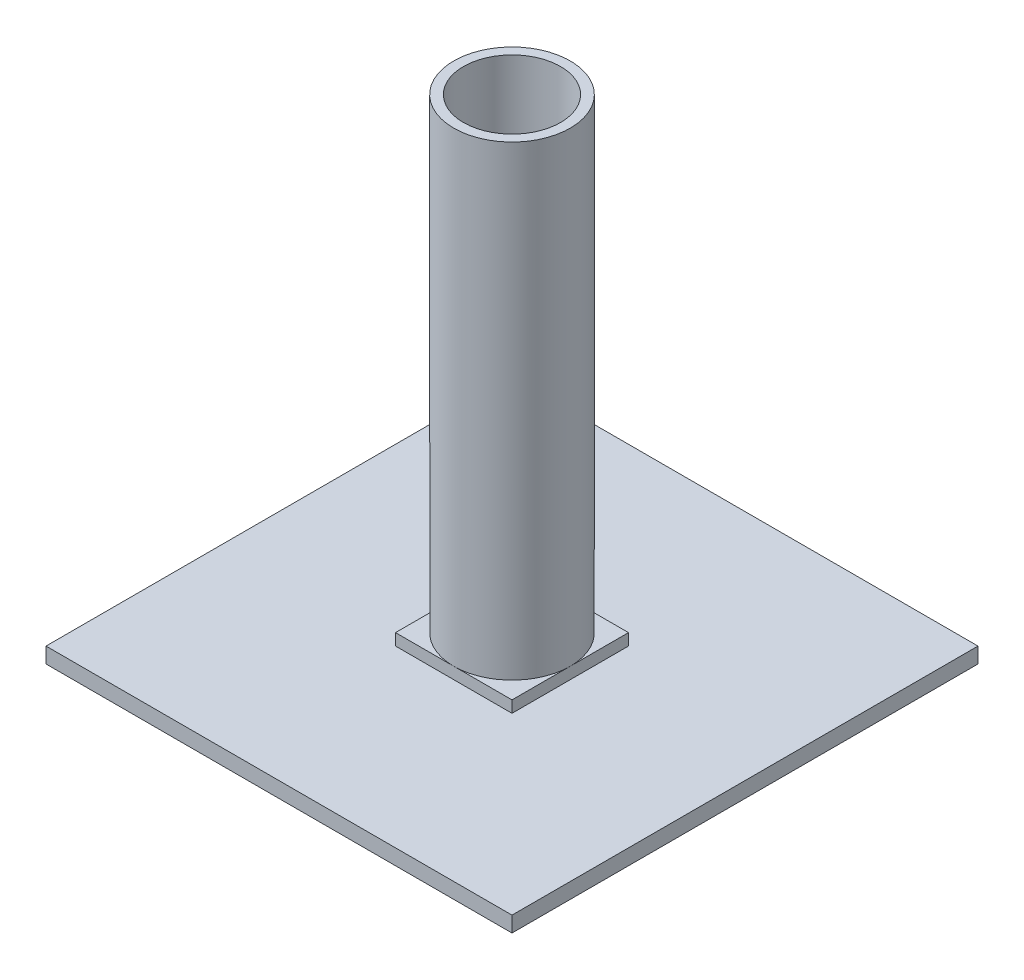
ISO-10303-21;
HEADER;
FILE_DESCRIPTION(('STEP AP214'),'2;1');
FILE_NAME('part.step','',(''),(''),'','','');
FILE_SCHEMA(('AUTOMOTIVE_DESIGN { 1 0 10303 214 1 1 1 1 }'));
ENDSEC;
DATA;
#1=APPLICATION_CONTEXT('core data for automotive mechanical design processes');
#2=APPLICATION_PROTOCOL_DEFINITION('international standard','automotive_design',2000,#1);
#3=PRODUCT_CONTEXT('',#1,'mechanical');
#4=PRODUCT('Part','Part','',(#3));
#5=PRODUCT_RELATED_PRODUCT_CATEGORY('part','',(#4));
#6=PRODUCT_DEFINITION_FORMATION('','',#4);
#7=PRODUCT_DEFINITION_CONTEXT('part definition',#1,'design');
#8=PRODUCT_DEFINITION('design','',#6,#7);
#9=PRODUCT_DEFINITION_SHAPE('','',#8);
#10=(LENGTH_UNIT() NAMED_UNIT(*) SI_UNIT(.MILLI.,.METRE.));
#11=(NAMED_UNIT(*) PLANE_ANGLE_UNIT() SI_UNIT($,.RADIAN.));
#12=(NAMED_UNIT(*) SI_UNIT($,.STERADIAN.) SOLID_ANGLE_UNIT());
#13=UNCERTAINTY_MEASURE_WITH_UNIT(LENGTH_MEASURE(1.E-05),#10,'distance_accuracy_value','');
#14=(GEOMETRIC_REPRESENTATION_CONTEXT(3) GLOBAL_UNCERTAINTY_ASSIGNED_CONTEXT((#13)) GLOBAL_UNIT_ASSIGNED_CONTEXT((#10,
#11,#12)) REPRESENTATION_CONTEXT('',''));
#15=CARTESIAN_POINT('',(0.,0.,0.));
#16=DIRECTION('',(0.,0.,1.));
#17=DIRECTION('',(1.,0.,0.));
#18=AXIS2_PLACEMENT_3D('',#15,#16,#17);
#19=CARTESIAN_POINT('',(0.,304.8,0.));
#20=DIRECTION('',(0.,1.,0.));
#21=DIRECTION('',(0.,0.,1.));
#22=AXIS2_PLACEMENT_3D('',#19,#20,#21);
#23=PLANE('',#22);
#24=CARTESIAN_POINT('',(0.,304.8,0.));
#25=DIRECTION('',(0.,1.,0.));
#26=DIRECTION('',(0.,0.,1.));
#27=AXIS2_PLACEMENT_3D('',#24,#25,#26);
#28=CIRCLE('',#27,38.1);
#29=CARTESIAN_POINT('',(0.,304.8,38.1));
#30=VERTEX_POINT('',#29);
#31=EDGE_CURVE('E11',#30,#30,#28,.T.);
#32=ORIENTED_EDGE('',*,*,#31,.T.);
#33=EDGE_LOOP('',(#32));
#34=FACE_BOUND('',#33,.T.);
#35=CARTESIAN_POINT('',(0.,304.8,0.));
#36=DIRECTION('',(0.,1.,0.));
#37=DIRECTION('',(0.,0.,1.));
#38=AXIS2_PLACEMENT_3D('',#35,#36,#37);
#39=CIRCLE('',#38,31.75);
#40=CARTESIAN_POINT('',(0.,304.8,31.75));
#41=VERTEX_POINT('',#40);
#42=EDGE_CURVE('E189',#41,#41,#39,.T.);
#43=ORIENTED_EDGE('',*,*,#42,.F.);
#44=EDGE_LOOP('',(#43));
#45=FACE_BOUND('',#44,.T.);
#46=ADVANCED_FACE('F32',(#34,#45),#23,.T.);
#47=CARTESIAN_POINT('',(0.,304.8,0.));
#48=DIRECTION('',(0.,-1.,0.));
#49=DIRECTION('',(0.,0.,-1.));
#50=AXIS2_PLACEMENT_3D('',#47,#48,#49);
#51=CYLINDRICAL_SURFACE('',#50,38.1);
#52=ORIENTED_EDGE('',*,*,#31,.F.);
#53=EDGE_LOOP('',(#52));
#54=FACE_BOUND('',#53,.T.);
#55=CARTESIAN_POINT('',(0.,0.,0.));
#56=DIRECTION('',(0.,1.,0.));
#57=DIRECTION('',(0.,0.,1.));
#58=AXIS2_PLACEMENT_3D('',#55,#56,#57);
#59=CIRCLE('',#58,38.1);
#60=CARTESIAN_POINT('',(0.,0.,38.1));
#61=VERTEX_POINT('',#60);
#62=CARTESIAN_POINT('',(38.1,0.,0.));
#63=VERTEX_POINT('',#62);
#64=EDGE_CURVE('E36',#61,#63,#59,.T.);
#65=ORIENTED_EDGE('',*,*,#64,.T.);
#66=CARTESIAN_POINT('',(0.,0.,-38.1));
#67=VERTEX_POINT('',#66);
#68=EDGE_CURVE('E222',#63,#67,#59,.T.);
#69=ORIENTED_EDGE('',*,*,#68,.T.);
#70=CARTESIAN_POINT('',(-38.1,0.,0.));
#71=VERTEX_POINT('',#70);
#72=EDGE_CURVE('E224',#67,#71,#59,.T.);
#73=ORIENTED_EDGE('',*,*,#72,.T.);
#74=EDGE_CURVE('E51',#71,#61,#59,.T.);
#75=ORIENTED_EDGE('',*,*,#74,.T.);
#76=EDGE_LOOP('',(#65,#69,#73,#75));
#77=FACE_BOUND('',#76,.T.);
#78=ADVANCED_FACE('F34',(#54,#77),#51,.T.);
#79=CARTESIAN_POINT('',(0.,304.8,0.));
#80=DIRECTION('',(0.,-1.,0.));
#81=DIRECTION('',(0.,0.,-1.));
#82=AXIS2_PLACEMENT_3D('',#79,#80,#81);
#83=CYLINDRICAL_SURFACE('',#82,31.75);
#84=ORIENTED_EDGE('',*,*,#42,.T.);
#85=EDGE_LOOP('',(#84));
#86=FACE_BOUND('',#85,.T.);
#87=CARTESIAN_POINT('',(0.,0.,0.));
#88=DIRECTION('',(0.,1.,0.));
#89=DIRECTION('',(0.,0.,1.));
#90=AXIS2_PLACEMENT_3D('',#87,#88,#89);
#91=CIRCLE('',#90,31.75);
#92=CARTESIAN_POINT('',(0.,0.,31.75));
#93=VERTEX_POINT('',#92);
#94=EDGE_CURVE('E180',#93,#93,#91,.T.);
#95=ORIENTED_EDGE('',*,*,#94,.F.);
#96=EDGE_LOOP('',(#95));
#97=FACE_BOUND('',#96,.T.);
#98=ADVANCED_FACE('F197',(#86,#97),#83,.F.);
#99=CARTESIAN_POINT('',(0.,0.,0.));
#100=DIRECTION('',(0.,1.,0.));
#101=DIRECTION('',(0.,0.,1.));
#102=AXIS2_PLACEMENT_3D('',#99,#100,#101);
#103=PLANE('',#102);
#104=ORIENTED_EDGE('',*,*,#94,.T.);
#105=EDGE_LOOP('',(#104));
#106=FACE_BOUND('',#105,.T.);
#107=ADVANCED_FACE('F195',(#106),#103,.T.);
#108=ORIENTED_EDGE('',*,*,#64,.F.);
#109=DIRECTION('',(1.,0.,0.));
#110=VECTOR('',#109,1.);
#111=CARTESIAN_POINT('',(-38.1,0.,38.1));
#112=LINE('',#111,#110);
#113=CARTESIAN_POINT('',(38.1,0.,38.1));
#114=VERTEX_POINT('',#113);
#115=EDGE_CURVE('E175',#61,#114,#112,.T.);
#116=ORIENTED_EDGE('',*,*,#115,.T.);
#117=DIRECTION('',(0.,0.,-1.));
#118=VECTOR('',#117,1.);
#119=CARTESIAN_POINT('',(38.1,0.,-38.1));
#120=LINE('',#119,#118);
#121=EDGE_CURVE('E164',#114,#63,#120,.T.);
#122=ORIENTED_EDGE('',*,*,#121,.T.);
#123=EDGE_LOOP('',(#108,#116,#122));
#124=FACE_BOUND('',#123,.T.);
#125=ADVANCED_FACE('F205',(#124),#103,.T.);
#126=ORIENTED_EDGE('',*,*,#68,.F.);
#127=CARTESIAN_POINT('',(38.1,0.,-38.1));
#128=VERTEX_POINT('',#127);
#129=EDGE_CURVE('E147',#63,#128,#120,.T.);
#130=ORIENTED_EDGE('',*,*,#129,.T.);
#131=DIRECTION('',(-1.,0.,0.));
#132=VECTOR('',#131,1.);
#133=CARTESIAN_POINT('',(-38.1,0.,-38.1));
#134=LINE('',#133,#132);
#135=EDGE_CURVE('E168',#128,#67,#134,.T.);
#136=ORIENTED_EDGE('',*,*,#135,.T.);
#137=EDGE_LOOP('',(#126,#130,#136));
#138=FACE_BOUND('',#137,.T.);
#139=ADVANCED_FACE('F235',(#138),#103,.T.);
#140=ORIENTED_EDGE('',*,*,#72,.F.);
#141=CARTESIAN_POINT('',(-38.1,0.,-38.1));
#142=VERTEX_POINT('',#141);
#143=EDGE_CURVE('E167',#67,#142,#134,.T.);
#144=ORIENTED_EDGE('',*,*,#143,.T.);
#145=DIRECTION('',(0.,0.,1.));
#146=VECTOR('',#145,1.);
#147=CARTESIAN_POINT('',(-38.1,0.,-38.1));
#148=LINE('',#147,#146);
#149=EDGE_CURVE('E172',#142,#71,#148,.T.);
#150=ORIENTED_EDGE('',*,*,#149,.T.);
#151=EDGE_LOOP('',(#140,#144,#150));
#152=FACE_BOUND('',#151,.T.);
#153=ADVANCED_FACE('F227',(#152),#103,.T.);
#154=ORIENTED_EDGE('',*,*,#74,.F.);
#155=CARTESIAN_POINT('',(-38.1,0.,38.1));
#156=VERTEX_POINT('',#155);
#157=EDGE_CURVE('E171',#71,#156,#148,.T.);
#158=ORIENTED_EDGE('',*,*,#157,.T.);
#159=EDGE_CURVE('E47',#156,#61,#112,.T.);
#160=ORIENTED_EDGE('',*,*,#159,.T.);
#161=EDGE_LOOP('',(#154,#158,#160));
#162=FACE_BOUND('',#161,.T.);
#163=ADVANCED_FACE('F207',(#162),#103,.T.);
#164=CARTESIAN_POINT('',(38.1,-7.62,-38.1));
#165=DIRECTION('',(1.,0.,0.));
#166=DIRECTION('',(0.,0.,-1.));
#167=AXIS2_PLACEMENT_3D('',#164,#165,#166);
#168=PLANE('',#167);
#169=ORIENTED_EDGE('',*,*,#121,.F.);
#170=DIRECTION('',(0.,1.,0.));
#171=VECTOR('',#170,1.);
#172=CARTESIAN_POINT('',(38.1,-7.62,38.1));
#173=LINE('',#172,#171);
#174=CARTESIAN_POINT('',(38.1,-7.62,38.1));
#175=VERTEX_POINT('',#174);
#176=EDGE_CURVE('E177',#175,#114,#173,.T.);
#177=ORIENTED_EDGE('',*,*,#176,.F.);
#178=DIRECTION('',(0.,0.,-1.));
#179=VECTOR('',#178,1.);
#180=CARTESIAN_POINT('',(38.1,-7.62,-38.1));
#181=LINE('',#180,#179);
#182=CARTESIAN_POINT('',(38.1,-7.62,-38.1));
#183=VERTEX_POINT('',#182);
#184=EDGE_CURVE('E151',#175,#183,#181,.T.);
#185=ORIENTED_EDGE('',*,*,#184,.T.);
#186=DIRECTION('',(0.,1.,0.));
#187=VECTOR('',#186,1.);
#188=CARTESIAN_POINT('',(38.1,-7.62,-38.1));
#189=LINE('',#188,#187);
#190=EDGE_CURVE('E163',#183,#128,#189,.T.);
#191=ORIENTED_EDGE('',*,*,#190,.T.);
#192=ORIENTED_EDGE('',*,*,#129,.F.);
#193=EDGE_LOOP('',(#169,#177,#185,#191,#192));
#194=FACE_BOUND('',#193,.T.);
#195=ADVANCED_FACE('F239',(#194),#168,.T.);
#196=CARTESIAN_POINT('',(-38.1,-7.62,38.1));
#197=DIRECTION('',(0.,0.,1.));
#198=DIRECTION('',(1.,0.,0.));
#199=AXIS2_PLACEMENT_3D('',#196,#197,#198);
#200=PLANE('',#199);
#201=ORIENTED_EDGE('',*,*,#159,.F.);
#202=DIRECTION('',(0.,1.,0.));
#203=VECTOR('',#202,1.);
#204=CARTESIAN_POINT('',(-38.1,-7.62,38.1));
#205=LINE('',#204,#203);
#206=CARTESIAN_POINT('',(-38.1,-7.62,38.1));
#207=VERTEX_POINT('',#206);
#208=EDGE_CURVE('E181',#207,#156,#205,.T.);
#209=ORIENTED_EDGE('',*,*,#208,.F.);
#210=DIRECTION('',(1.,0.,0.));
#211=VECTOR('',#210,1.);
#212=CARTESIAN_POINT('',(-38.1,-7.62,38.1));
#213=LINE('',#212,#211);
#214=EDGE_CURVE('E160',#207,#175,#213,.T.);
#215=ORIENTED_EDGE('',*,*,#214,.T.);
#216=ORIENTED_EDGE('',*,*,#176,.T.);
#217=ORIENTED_EDGE('',*,*,#115,.F.);
#218=EDGE_LOOP('',(#201,#209,#215,#216,#217));
#219=FACE_BOUND('',#218,.T.);
#220=ADVANCED_FACE('F251',(#219),#200,.T.);
#221=CARTESIAN_POINT('',(-38.1,-7.62,-38.1));
#222=DIRECTION('',(-1.,0.,0.));
#223=DIRECTION('',(0.,0.,1.));
#224=AXIS2_PLACEMENT_3D('',#221,#222,#223);
#225=PLANE('',#224);
#226=ORIENTED_EDGE('',*,*,#149,.F.);
#227=DIRECTION('',(0.,1.,0.));
#228=VECTOR('',#227,1.);
#229=CARTESIAN_POINT('',(-38.1,-7.62,-38.1));
#230=LINE('',#229,#228);
#231=CARTESIAN_POINT('',(-38.1,-7.62,-38.1));
#232=VERTEX_POINT('',#231);
#233=EDGE_CURVE('E184',#232,#142,#230,.T.);
#234=ORIENTED_EDGE('',*,*,#233,.F.);
#235=DIRECTION('',(0.,0.,1.));
#236=VECTOR('',#235,1.);
#237=CARTESIAN_POINT('',(-38.1,-7.62,-38.1));
#238=LINE('',#237,#236);
#239=EDGE_CURVE('E157',#232,#207,#238,.T.);
#240=ORIENTED_EDGE('',*,*,#239,.T.);
#241=ORIENTED_EDGE('',*,*,#208,.T.);
#242=ORIENTED_EDGE('',*,*,#157,.F.);
#243=EDGE_LOOP('',(#226,#234,#240,#241,#242));
#244=FACE_BOUND('',#243,.T.);
#245=ADVANCED_FACE('F245',(#244),#225,.T.);
#246=CARTESIAN_POINT('',(-38.1,-7.62,-38.1));
#247=DIRECTION('',(0.,0.,-1.));
#248=DIRECTION('',(-1.,0.,0.));
#249=AXIS2_PLACEMENT_3D('',#246,#247,#248);
#250=PLANE('',#249);
#251=ORIENTED_EDGE('',*,*,#135,.F.);
#252=ORIENTED_EDGE('',*,*,#190,.F.);
#253=DIRECTION('',(-1.,0.,0.));
#254=VECTOR('',#253,1.);
#255=CARTESIAN_POINT('',(-38.1,-7.62,-38.1));
#256=LINE('',#255,#254);
#257=EDGE_CURVE('E154',#183,#232,#256,.T.);
#258=ORIENTED_EDGE('',*,*,#257,.T.);
#259=ORIENTED_EDGE('',*,*,#233,.T.);
#260=ORIENTED_EDGE('',*,*,#143,.F.);
#261=EDGE_LOOP('',(#251,#252,#258,#259,#260));
#262=FACE_BOUND('',#261,.T.);
#263=ADVANCED_FACE('F231',(#262),#250,.T.);
#264=CARTESIAN_POINT('',(0.,-7.62,0.));
#265=DIRECTION('',(0.,1.,0.));
#266=DIRECTION('',(0.,0.,1.));
#267=AXIS2_PLACEMENT_3D('',#264,#265,#266);
#268=PLANE('',#267);
#269=DIRECTION('',(0.,0.,1.));
#270=VECTOR('',#269,1.);
#271=CARTESIAN_POINT('',(-152.4,-7.62,152.4));
#272=LINE('',#271,#270);
#273=CARTESIAN_POINT('',(-152.4,-7.62,-152.4));
#274=VERTEX_POINT('',#273);
#275=CARTESIAN_POINT('',(-152.4,-7.62,152.4));
#276=VERTEX_POINT('',#275);
#277=EDGE_CURVE('E141',#274,#276,#272,.T.);
#278=ORIENTED_EDGE('',*,*,#277,.T.);
#279=DIRECTION('',(1.,0.,0.));
#280=VECTOR('',#279,1.);
#281=CARTESIAN_POINT('',(152.4,-7.62,152.4));
#282=LINE('',#281,#280);
#283=CARTESIAN_POINT('',(152.4,-7.62,152.4));
#284=VERTEX_POINT('',#283);
#285=EDGE_CURVE('E113',#276,#284,#282,.T.);
#286=ORIENTED_EDGE('',*,*,#285,.T.);
#287=DIRECTION('',(0.,0.,-1.));
#288=VECTOR('',#287,1.);
#289=CARTESIAN_POINT('',(152.4,-7.62,152.4));
#290=LINE('',#289,#288);
#291=CARTESIAN_POINT('',(152.4,-7.62,-152.4));
#292=VERTEX_POINT('',#291);
#293=EDGE_CURVE('E136',#284,#292,#290,.T.);
#294=ORIENTED_EDGE('',*,*,#293,.T.);
#295=DIRECTION('',(-1.,0.,0.));
#296=VECTOR('',#295,1.);
#297=CARTESIAN_POINT('',(152.4,-7.62,-152.4));
#298=LINE('',#297,#296);
#299=EDGE_CURVE('E133',#292,#274,#298,.T.);
#300=ORIENTED_EDGE('',*,*,#299,.T.);
#301=EDGE_LOOP('',(#278,#286,#294,#300));
#302=FACE_BOUND('',#301,.T.);
#303=ORIENTED_EDGE('',*,*,#184,.F.);
#304=ORIENTED_EDGE('',*,*,#214,.F.);
#305=ORIENTED_EDGE('',*,*,#239,.F.);
#306=ORIENTED_EDGE('',*,*,#257,.F.);
#307=EDGE_LOOP('',(#303,#304,#305,#306));
#308=FACE_BOUND('',#307,.T.);
#309=ADVANCED_FACE('F242',(#302,#308),#268,.T.);
#310=CARTESIAN_POINT('',(-152.4,-17.78,152.4));
#311=DIRECTION('',(-1.,0.,0.));
#312=DIRECTION('',(0.,0.,1.));
#313=AXIS2_PLACEMENT_3D('',#310,#311,#312);
#314=PLANE('',#313);
#315=ORIENTED_EDGE('',*,*,#277,.F.);
#316=DIRECTION('',(0.,1.,0.));
#317=VECTOR('',#316,1.);
#318=CARTESIAN_POINT('',(-152.4,-17.78,-152.4));
#319=LINE('',#318,#317);
#320=CARTESIAN_POINT('',(-152.4,-17.78,-152.4));
#321=VERTEX_POINT('',#320);
#322=EDGE_CURVE('E132',#321,#274,#319,.T.);
#323=ORIENTED_EDGE('',*,*,#322,.F.);
#324=DIRECTION('',(0.,0.,1.));
#325=VECTOR('',#324,1.);
#326=CARTESIAN_POINT('',(-152.4,-17.78,152.4));
#327=LINE('',#326,#325);
#328=CARTESIAN_POINT('',(-152.4,-17.78,152.4));
#329=VERTEX_POINT('',#328);
#330=EDGE_CURVE('E126',#321,#329,#327,.T.);
#331=ORIENTED_EDGE('',*,*,#330,.T.);
#332=DIRECTION('',(0.,1.,0.));
#333=VECTOR('',#332,1.);
#334=CARTESIAN_POINT('',(-152.4,-17.78,152.4));
#335=LINE('',#334,#333);
#336=EDGE_CURVE('E108',#329,#276,#335,.T.);
#337=ORIENTED_EDGE('',*,*,#336,.T.);
#338=EDGE_LOOP('',(#315,#323,#331,#337));
#339=FACE_BOUND('',#338,.T.);
#340=ADVANCED_FACE('F131',(#339),#314,.T.);
#341=CARTESIAN_POINT('',(152.4,-17.78,-152.4));
#342=DIRECTION('',(0.,0.,-1.));
#343=DIRECTION('',(-1.,0.,0.));
#344=AXIS2_PLACEMENT_3D('',#341,#342,#343);
#345=PLANE('',#344);
#346=ORIENTED_EDGE('',*,*,#299,.F.);
#347=DIRECTION('',(0.,1.,0.));
#348=VECTOR('',#347,1.);
#349=CARTESIAN_POINT('',(152.4,-17.78,-152.4));
#350=LINE('',#349,#348);
#351=CARTESIAN_POINT('',(152.4,-17.78,-152.4));
#352=VERTEX_POINT('',#351);
#353=EDGE_CURVE('E148',#352,#292,#350,.T.);
#354=ORIENTED_EDGE('',*,*,#353,.F.);
#355=DIRECTION('',(-1.,0.,0.));
#356=VECTOR('',#355,1.);
#357=CARTESIAN_POINT('',(152.4,-17.78,-152.4));
#358=LINE('',#357,#356);
#359=EDGE_CURVE('E119',#352,#321,#358,.T.);
#360=ORIENTED_EDGE('',*,*,#359,.T.);
#361=ORIENTED_EDGE('',*,*,#322,.T.);
#362=EDGE_LOOP('',(#346,#354,#360,#361));
#363=FACE_BOUND('',#362,.T.);
#364=ADVANCED_FACE('F269',(#363),#345,.T.);
#365=CARTESIAN_POINT('',(152.4,-17.78,152.4));
#366=DIRECTION('',(1.,0.,0.));
#367=DIRECTION('',(0.,0.,-1.));
#368=AXIS2_PLACEMENT_3D('',#365,#366,#367);
#369=PLANE('',#368);
#370=ORIENTED_EDGE('',*,*,#293,.F.);
#371=DIRECTION('',(0.,1.,0.));
#372=VECTOR('',#371,1.);
#373=CARTESIAN_POINT('',(152.4,-17.78,152.4));
#374=LINE('',#373,#372);
#375=CARTESIAN_POINT('',(152.4,-17.78,152.4));
#376=VERTEX_POINT('',#375);
#377=EDGE_CURVE('E118',#376,#284,#374,.T.);
#378=ORIENTED_EDGE('',*,*,#377,.F.);
#379=DIRECTION('',(0.,0.,-1.));
#380=VECTOR('',#379,1.);
#381=CARTESIAN_POINT('',(152.4,-17.78,152.4));
#382=LINE('',#381,#380);
#383=EDGE_CURVE('E129',#376,#352,#382,.T.);
#384=ORIENTED_EDGE('',*,*,#383,.T.);
#385=ORIENTED_EDGE('',*,*,#353,.T.);
#386=EDGE_LOOP('',(#370,#378,#384,#385));
#387=FACE_BOUND('',#386,.T.);
#388=ADVANCED_FACE('F274',(#387),#369,.T.);
#389=CARTESIAN_POINT('',(152.4,-17.78,152.4));
#390=DIRECTION('',(0.,0.,1.));
#391=DIRECTION('',(1.,0.,0.));
#392=AXIS2_PLACEMENT_3D('',#389,#390,#391);
#393=PLANE('',#392);
#394=ORIENTED_EDGE('',*,*,#285,.F.);
#395=ORIENTED_EDGE('',*,*,#336,.F.);
#396=DIRECTION('',(1.,0.,0.));
#397=VECTOR('',#396,1.);
#398=CARTESIAN_POINT('',(152.4,-17.78,152.4));
#399=LINE('',#398,#397);
#400=EDGE_CURVE('E111',#329,#376,#399,.T.);
#401=ORIENTED_EDGE('',*,*,#400,.T.);
#402=ORIENTED_EDGE('',*,*,#377,.T.);
#403=EDGE_LOOP('',(#394,#395,#401,#402));
#404=FACE_BOUND('',#403,.T.);
#405=ADVANCED_FACE('F110',(#404),#393,.T.);
#406=CARTESIAN_POINT('',(0.,-17.78,0.));
#407=DIRECTION('',(0.,1.,0.));
#408=DIRECTION('',(0.,0.,1.));
#409=AXIS2_PLACEMENT_3D('',#406,#407,#408);
#410=PLANE('',#409);
#411=ORIENTED_EDGE('',*,*,#330,.F.);
#412=ORIENTED_EDGE('',*,*,#359,.F.);
#413=ORIENTED_EDGE('',*,*,#383,.F.);
#414=ORIENTED_EDGE('',*,*,#400,.F.);
#415=EDGE_LOOP('',(#411,#412,#413,#414));
#416=FACE_BOUND('',#415,.T.);
#417=ADVANCED_FACE('F124',(#416),#410,.F.);
#418=CLOSED_SHELL('',(#46,#78,#98,#107,#125,#139,#153,#163,#195,#220,#245,#263,#309,#340,#364,
#388,#405,#417));
#419=MANIFOLD_SOLID_BREP('B2',#418);
#420=ADVANCED_BREP_SHAPE_REPRESENTATION('',(#18,#419),#14);
#421=SHAPE_DEFINITION_REPRESENTATION(#9,#420);
ENDSEC;
END-ISO-10303-21;
